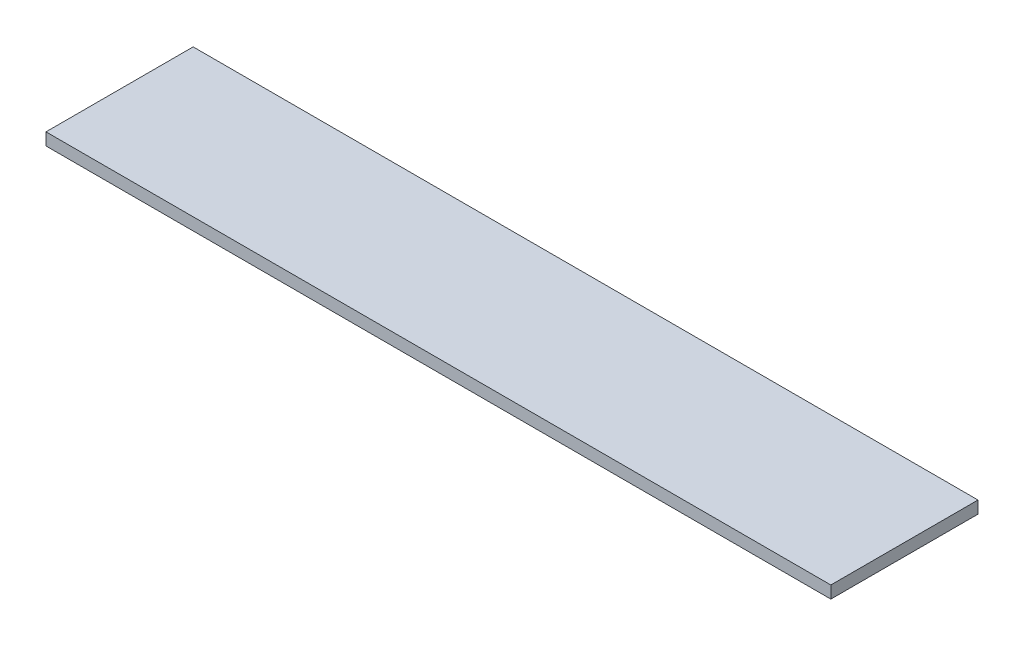
ISO-10303-21;
HEADER;
FILE_DESCRIPTION(('STEP AP214'),'2;1');
FILE_NAME('part.step','',(''),(''),'','','');
FILE_SCHEMA(('AUTOMOTIVE_DESIGN { 1 0 10303 214 1 1 1 1 }'));
ENDSEC;
DATA;
#1=APPLICATION_CONTEXT('core data for automotive mechanical design processes');
#2=APPLICATION_PROTOCOL_DEFINITION('international standard','automotive_design',2000,#1);
#3=PRODUCT_CONTEXT('',#1,'mechanical');
#4=PRODUCT('Part','Part','',(#3));
#5=PRODUCT_RELATED_PRODUCT_CATEGORY('part','',(#4));
#6=PRODUCT_DEFINITION_FORMATION('','',#4);
#7=PRODUCT_DEFINITION_CONTEXT('part definition',#1,'design');
#8=PRODUCT_DEFINITION('design','',#6,#7);
#9=PRODUCT_DEFINITION_SHAPE('','',#8);
#10=(LENGTH_UNIT() NAMED_UNIT(*) SI_UNIT(.MILLI.,.METRE.));
#11=(NAMED_UNIT(*) PLANE_ANGLE_UNIT() SI_UNIT($,.RADIAN.));
#12=(NAMED_UNIT(*) SI_UNIT($,.STERADIAN.) SOLID_ANGLE_UNIT());
#13=UNCERTAINTY_MEASURE_WITH_UNIT(LENGTH_MEASURE(1.E-05),#10,'distance_accuracy_value','');
#14=(GEOMETRIC_REPRESENTATION_CONTEXT(3) GLOBAL_UNCERTAINTY_ASSIGNED_CONTEXT((#13)) GLOBAL_UNIT_ASSIGNED_CONTEXT((#10,
#11,#12)) REPRESENTATION_CONTEXT('',''));
#15=CARTESIAN_POINT('',(0.,0.,0.));
#16=DIRECTION('',(0.,0.,1.));
#17=DIRECTION('',(1.,0.,0.));
#18=AXIS2_PLACEMENT_3D('',#15,#16,#17);
#19=CARTESIAN_POINT('',(0.,6.35,0.));
#20=DIRECTION('',(1.,0.,0.));
#21=DIRECTION('',(0.,0.,-1.));
#22=AXIS2_PLACEMENT_3D('',#19,#20,#21);
#23=PLANE('',#22);
#24=DIRECTION('',(0.,0.,1.));
#25=VECTOR('',#24,1.);
#26=CARTESIAN_POINT('',(0.,0.,0.));
#27=LINE('',#26,#25);
#28=CARTESIAN_POINT('',(0.,0.,-76.2));
#29=VERTEX_POINT('',#28);
#30=CARTESIAN_POINT('',(0.,0.,0.));
#31=VERTEX_POINT('',#30);
#32=EDGE_CURVE('E95',#29,#31,#27,.T.);
#33=ORIENTED_EDGE('',*,*,#32,.T.);
#34=DIRECTION('',(0.,-1.,0.));
#35=VECTOR('',#34,1.);
#36=CARTESIAN_POINT('',(0.,6.35,0.));
#37=LINE('',#36,#35);
#38=CARTESIAN_POINT('',(0.,6.35,0.));
#39=VERTEX_POINT('',#38);
#40=EDGE_CURVE('E11',#39,#31,#37,.T.);
#41=ORIENTED_EDGE('',*,*,#40,.F.);
#42=DIRECTION('',(0.,0.,1.));
#43=VECTOR('',#42,1.);
#44=CARTESIAN_POINT('',(0.,6.35,0.));
#45=LINE('',#44,#43);
#46=CARTESIAN_POINT('',(0.,6.35,-76.2));
#47=VERTEX_POINT('',#46);
#48=EDGE_CURVE('E83',#47,#39,#45,.T.);
#49=ORIENTED_EDGE('',*,*,#48,.F.);
#50=DIRECTION('',(0.,-1.,0.));
#51=VECTOR('',#50,1.);
#52=CARTESIAN_POINT('',(0.,6.35,-76.2));
#53=LINE('',#52,#51);
#54=EDGE_CURVE('E91',#47,#29,#53,.T.);
#55=ORIENTED_EDGE('',*,*,#54,.T.);
#56=EDGE_LOOP('',(#33,#41,#49,#55));
#57=FACE_BOUND('',#56,.T.);
#58=ADVANCED_FACE('F32',(#57),#23,.F.);
#59=CARTESIAN_POINT('',(0.,6.35,0.));
#60=DIRECTION('',(0.,0.,-1.));
#61=DIRECTION('',(-1.,0.,0.));
#62=AXIS2_PLACEMENT_3D('',#59,#60,#61);
#63=PLANE('',#62);
#64=DIRECTION('',(1.,0.,0.));
#65=VECTOR('',#64,1.);
#66=CARTESIAN_POINT('',(0.,0.,0.));
#67=LINE('',#66,#65);
#68=CARTESIAN_POINT('',(406.4,0.,0.));
#69=VERTEX_POINT('',#68);
#70=EDGE_CURVE('E87',#31,#69,#67,.T.);
#71=ORIENTED_EDGE('',*,*,#70,.T.);
#72=DIRECTION('',(0.,-1.,0.));
#73=VECTOR('',#72,1.);
#74=CARTESIAN_POINT('',(406.4,6.35,0.));
#75=LINE('',#74,#73);
#76=CARTESIAN_POINT('',(406.4,6.35,0.));
#77=VERTEX_POINT('',#76);
#78=EDGE_CURVE('E40',#77,#69,#75,.T.);
#79=ORIENTED_EDGE('',*,*,#78,.F.);
#80=DIRECTION('',(1.,0.,0.));
#81=VECTOR('',#80,1.);
#82=CARTESIAN_POINT('',(0.,6.35,0.));
#83=LINE('',#82,#81);
#84=EDGE_CURVE('E78',#39,#77,#83,.T.);
#85=ORIENTED_EDGE('',*,*,#84,.F.);
#86=ORIENTED_EDGE('',*,*,#40,.T.);
#87=EDGE_LOOP('',(#71,#79,#85,#86));
#88=FACE_BOUND('',#87,.T.);
#89=ADVANCED_FACE('F86',(#88),#63,.F.);
#90=CARTESIAN_POINT('',(406.4,6.35,0.));
#91=DIRECTION('',(-1.,0.,0.));
#92=DIRECTION('',(0.,0.,1.));
#93=AXIS2_PLACEMENT_3D('',#90,#91,#92);
#94=PLANE('',#93);
#95=DIRECTION('',(0.,0.,-1.));
#96=VECTOR('',#95,1.);
#97=CARTESIAN_POINT('',(406.4,0.,0.));
#98=LINE('',#97,#96);
#99=CARTESIAN_POINT('',(406.4,0.,-76.2));
#100=VERTEX_POINT('',#99);
#101=EDGE_CURVE('E65',#69,#100,#98,.T.);
#102=ORIENTED_EDGE('',*,*,#101,.T.);
#103=DIRECTION('',(0.,-1.,0.));
#104=VECTOR('',#103,1.);
#105=CARTESIAN_POINT('',(406.4,6.35,-76.2));
#106=LINE('',#105,#104);
#107=CARTESIAN_POINT('',(406.4,6.35,-76.2));
#108=VERTEX_POINT('',#107);
#109=EDGE_CURVE('E88',#108,#100,#106,.T.);
#110=ORIENTED_EDGE('',*,*,#109,.F.);
#111=DIRECTION('',(0.,0.,-1.));
#112=VECTOR('',#111,1.);
#113=CARTESIAN_POINT('',(406.4,6.35,0.));
#114=LINE('',#113,#112);
#115=EDGE_CURVE('E81',#77,#108,#114,.T.);
#116=ORIENTED_EDGE('',*,*,#115,.F.);
#117=ORIENTED_EDGE('',*,*,#78,.T.);
#118=EDGE_LOOP('',(#102,#110,#116,#117));
#119=FACE_BOUND('',#118,.T.);
#120=ADVANCED_FACE('F89',(#119),#94,.F.);
#121=CARTESIAN_POINT('',(0.,6.35,-76.2));
#122=DIRECTION('',(0.,0.,1.));
#123=DIRECTION('',(1.,0.,0.));
#124=AXIS2_PLACEMENT_3D('',#121,#122,#123);
#125=PLANE('',#124);
#126=DIRECTION('',(-1.,0.,0.));
#127=VECTOR('',#126,1.);
#128=CARTESIAN_POINT('',(0.,0.,-76.2));
#129=LINE('',#128,#127);
#130=EDGE_CURVE('E71',#100,#29,#129,.T.);
#131=ORIENTED_EDGE('',*,*,#130,.T.);
#132=ORIENTED_EDGE('',*,*,#54,.F.);
#133=DIRECTION('',(-1.,0.,0.));
#134=VECTOR('',#133,1.);
#135=CARTESIAN_POINT('',(0.,6.35,-76.2));
#136=LINE('',#135,#134);
#137=EDGE_CURVE('E48',#108,#47,#136,.T.);
#138=ORIENTED_EDGE('',*,*,#137,.F.);
#139=ORIENTED_EDGE('',*,*,#109,.T.);
#140=EDGE_LOOP('',(#131,#132,#138,#139));
#141=FACE_BOUND('',#140,.T.);
#142=ADVANCED_FACE('F102',(#141),#125,.F.);
#143=CARTESIAN_POINT('',(0.,6.35,0.));
#144=DIRECTION('',(0.,-1.,0.));
#145=DIRECTION('',(0.,0.,-1.));
#146=AXIS2_PLACEMENT_3D('',#143,#144,#145);
#147=PLANE('',#146);
#148=ORIENTED_EDGE('',*,*,#48,.T.);
#149=ORIENTED_EDGE('',*,*,#84,.T.);
#150=ORIENTED_EDGE('',*,*,#115,.T.);
#151=ORIENTED_EDGE('',*,*,#137,.T.);
#152=EDGE_LOOP('',(#148,#149,#150,#151));
#153=FACE_BOUND('',#152,.T.);
#154=ADVANCED_FACE('F79',(#153),#147,.F.);
#155=CARTESIAN_POINT('',(0.,0.,0.));
#156=DIRECTION('',(0.,-1.,0.));
#157=DIRECTION('',(0.,0.,-1.));
#158=AXIS2_PLACEMENT_3D('',#155,#156,#157);
#159=PLANE('',#158);
#160=ORIENTED_EDGE('',*,*,#32,.F.);
#161=ORIENTED_EDGE('',*,*,#130,.F.);
#162=ORIENTED_EDGE('',*,*,#101,.F.);
#163=ORIENTED_EDGE('',*,*,#70,.F.);
#164=EDGE_LOOP('',(#160,#161,#162,#163));
#165=FACE_BOUND('',#164,.T.);
#166=ADVANCED_FACE('F105',(#165),#159,.T.);
#167=CLOSED_SHELL('',(#58,#89,#120,#142,#154,#166));
#168=MANIFOLD_SOLID_BREP('B2',#167);
#169=ADVANCED_BREP_SHAPE_REPRESENTATION('',(#18,#168),#14);
#170=SHAPE_DEFINITION_REPRESENTATION(#9,#169);
ENDSEC;
END-ISO-10303-21;
